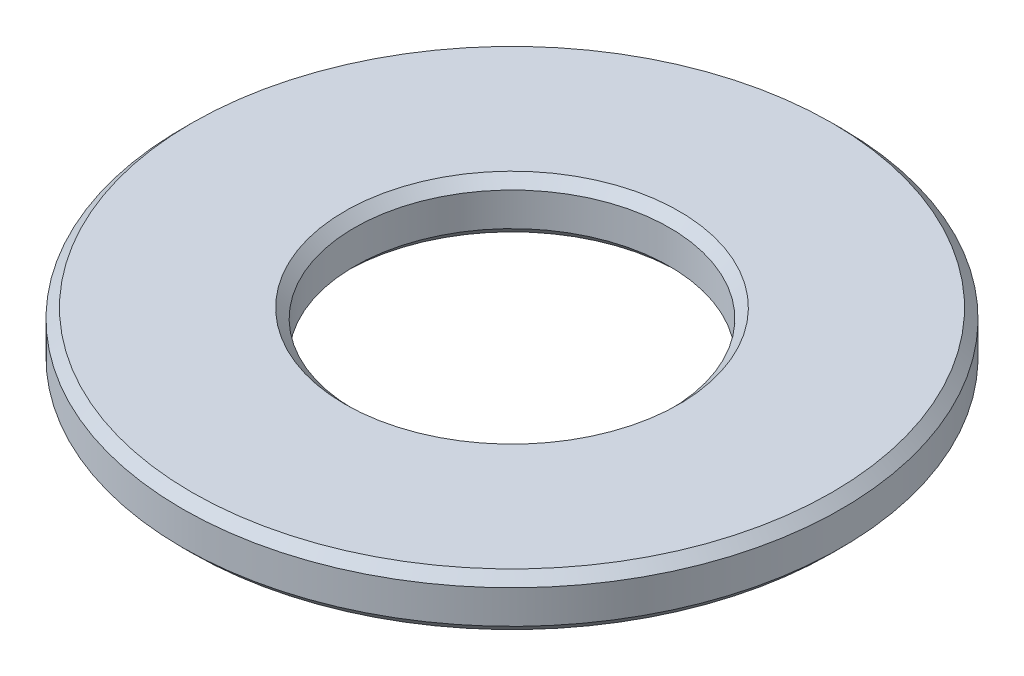
ISO-10303-21;
HEADER;
FILE_DESCRIPTION(('STEP AP214'),'2;1');
FILE_NAME('part.step','',(''),(''),'','','');
FILE_SCHEMA(('AUTOMOTIVE_DESIGN { 1 0 10303 214 1 1 1 1 }'));
ENDSEC;
DATA;
#1=APPLICATION_CONTEXT('core data for automotive mechanical design processes');
#2=APPLICATION_PROTOCOL_DEFINITION('international standard','automotive_design',2000,#1);
#3=PRODUCT_CONTEXT('',#1,'mechanical');
#4=PRODUCT('Part','Part','',(#3));
#5=PRODUCT_RELATED_PRODUCT_CATEGORY('part','',(#4));
#6=PRODUCT_DEFINITION_FORMATION('','',#4);
#7=PRODUCT_DEFINITION_CONTEXT('part definition',#1,'design');
#8=PRODUCT_DEFINITION('design','',#6,#7);
#9=PRODUCT_DEFINITION_SHAPE('','',#8);
#10=(LENGTH_UNIT() NAMED_UNIT(*) SI_UNIT(.MILLI.,.METRE.));
#11=(NAMED_UNIT(*) PLANE_ANGLE_UNIT() SI_UNIT($,.RADIAN.));
#12=(NAMED_UNIT(*) SI_UNIT($,.STERADIAN.) SOLID_ANGLE_UNIT());
#13=UNCERTAINTY_MEASURE_WITH_UNIT(LENGTH_MEASURE(1.E-05),#10,'distance_accuracy_value','');
#14=(GEOMETRIC_REPRESENTATION_CONTEXT(3) GLOBAL_UNCERTAINTY_ASSIGNED_CONTEXT((#13)) GLOBAL_UNIT_ASSIGNED_CONTEXT((#10,
#11,#12)) REPRESENTATION_CONTEXT('',''));
#15=CARTESIAN_POINT('',(0.,0.,0.));
#16=DIRECTION('',(0.,0.,1.));
#17=DIRECTION('',(1.,0.,0.));
#18=AXIS2_PLACEMENT_3D('',#15,#16,#17);
#19=CARTESIAN_POINT('',(0.,0.55,0.));
#20=DIRECTION('',(0.,1.,0.));
#21=DIRECTION('',(0.,0.,1.));
#22=AXIS2_PLACEMENT_3D('',#19,#20,#21);
#23=PLANE('',#22);
#24=CARTESIAN_POINT('',(0.,0.55,0.));
#25=DIRECTION('',(0.,1.,0.));
#26=DIRECTION('',(0.,0.,1.));
#27=AXIS2_PLACEMENT_3D('',#24,#25,#26);
#28=CIRCLE('',#27,3.35);
#29=CARTESIAN_POINT('',(0.,0.55,3.35));
#30=VERTEX_POINT('',#29);
#31=EDGE_CURVE('E61',#30,#30,#28,.T.);
#32=ORIENTED_EDGE('',*,*,#31,.T.);
#33=EDGE_LOOP('',(#32));
#34=FACE_BOUND('',#33,.T.);
#35=CARTESIAN_POINT('',(0.,0.55,0.));
#36=DIRECTION('',(0.,1.,0.));
#37=DIRECTION('',(0.,0.,1.));
#38=AXIS2_PLACEMENT_3D('',#35,#36,#37);
#39=CIRCLE('',#38,1.75);
#40=CARTESIAN_POINT('',(0.,0.55,1.75));
#41=VERTEX_POINT('',#40);
#42=EDGE_CURVE('E64',#41,#41,#39,.F.);
#43=ORIENTED_EDGE('',*,*,#42,.T.);
#44=EDGE_LOOP('',(#43));
#45=FACE_BOUND('',#44,.T.);
#46=ADVANCED_FACE('F35',(#34,#45),#23,.T.);
#47=CARTESIAN_POINT('',(0.,0.,0.));
#48=DIRECTION('',(0.,1.,0.));
#49=DIRECTION('',(0.,0.,1.));
#50=AXIS2_PLACEMENT_3D('',#47,#48,#49);
#51=PLANE('',#50);
#52=CARTESIAN_POINT('',(0.,0.,0.));
#53=DIRECTION('',(0.,1.,0.));
#54=DIRECTION('',(0.,0.,1.));
#55=AXIS2_PLACEMENT_3D('',#52,#53,#54);
#56=CIRCLE('',#55,3.35);
#57=CARTESIAN_POINT('',(0.,0.,3.35));
#58=VERTEX_POINT('',#57);
#59=EDGE_CURVE('E46',#58,#58,#56,.F.);
#60=ORIENTED_EDGE('',*,*,#59,.T.);
#61=EDGE_LOOP('',(#60));
#62=FACE_BOUND('',#61,.T.);
#63=CARTESIAN_POINT('',(0.,0.,0.));
#64=DIRECTION('',(0.,1.,0.));
#65=DIRECTION('',(0.,0.,1.));
#66=AXIS2_PLACEMENT_3D('',#63,#64,#65);
#67=CIRCLE('',#66,1.75);
#68=CARTESIAN_POINT('',(0.,0.,1.75));
#69=VERTEX_POINT('',#68);
#70=EDGE_CURVE('E50',#69,#69,#67,.T.);
#71=ORIENTED_EDGE('',*,*,#70,.T.);
#72=EDGE_LOOP('',(#71));
#73=FACE_BOUND('',#72,.T.);
#74=ADVANCED_FACE('F82',(#62,#73),#51,.F.);
#75=CARTESIAN_POINT('',(0.,0.55,0.));
#76=DIRECTION('',(0.,-1.,0.));
#77=DIRECTION('',(0.,0.,-1.));
#78=AXIS2_PLACEMENT_3D('',#75,#76,#77);
#79=CYLINDRICAL_SURFACE('',#78,3.45);
#80=CARTESIAN_POINT('',(0.,0.45,0.));
#81=DIRECTION('',(0.,1.,0.));
#82=DIRECTION('',(0.,0.,1.));
#83=AXIS2_PLACEMENT_3D('',#80,#81,#82);
#84=CIRCLE('',#83,3.45);
#85=CARTESIAN_POINT('',(0.,0.45,3.45));
#86=VERTEX_POINT('',#85);
#87=EDGE_CURVE('E55',#86,#86,#84,.F.);
#88=ORIENTED_EDGE('',*,*,#87,.T.);
#89=EDGE_LOOP('',(#88));
#90=FACE_BOUND('',#89,.T.);
#91=CARTESIAN_POINT('',(0.,0.0999999999999985,0.));
#92=DIRECTION('',(0.,1.,0.));
#93=DIRECTION('',(0.,0.,1.));
#94=AXIS2_PLACEMENT_3D('',#91,#92,#93);
#95=CIRCLE('',#94,3.45);
#96=CARTESIAN_POINT('',(0.,0.0999999999999985,3.45));
#97=VERTEX_POINT('',#96);
#98=EDGE_CURVE('E58',#97,#97,#95,.T.);
#99=ORIENTED_EDGE('',*,*,#98,.T.);
#100=EDGE_LOOP('',(#99));
#101=FACE_BOUND('',#100,.T.);
#102=ADVANCED_FACE('F88',(#90,#101),#79,.T.);
#103=CARTESIAN_POINT('',(0.,0.55,0.));
#104=DIRECTION('',(0.,-1.,0.));
#105=DIRECTION('',(0.,0.,-1.));
#106=AXIS2_PLACEMENT_3D('',#103,#104,#105);
#107=CYLINDRICAL_SURFACE('',#106,1.65);
#108=CARTESIAN_POINT('',(0.,0.45,0.));
#109=DIRECTION('',(0.,1.,0.));
#110=DIRECTION('',(0.,0.,1.));
#111=AXIS2_PLACEMENT_3D('',#108,#109,#110);
#112=CIRCLE('',#111,1.65);
#113=CARTESIAN_POINT('',(0.,0.45,1.65));
#114=VERTEX_POINT('',#113);
#115=EDGE_CURVE('E10',#114,#114,#112,.T.);
#116=ORIENTED_EDGE('',*,*,#115,.T.);
#117=EDGE_LOOP('',(#116));
#118=FACE_BOUND('',#117,.T.);
#119=CARTESIAN_POINT('',(0.,0.1,0.));
#120=DIRECTION('',(0.,1.,0.));
#121=DIRECTION('',(0.,0.,1.));
#122=AXIS2_PLACEMENT_3D('',#119,#120,#121);
#123=CIRCLE('',#122,1.65);
#124=CARTESIAN_POINT('',(0.,0.1,1.65));
#125=VERTEX_POINT('',#124);
#126=EDGE_CURVE('E42',#125,#125,#123,.F.);
#127=ORIENTED_EDGE('',*,*,#126,.T.);
#128=EDGE_LOOP('',(#127));
#129=FACE_BOUND('',#128,.T.);
#130=ADVANCED_FACE('F92',(#118,#129),#107,.F.);
#131=CARTESIAN_POINT('',(0.,0.55,0.));
#132=DIRECTION('',(0.,-1.,0.));
#133=DIRECTION('',(0.,0.,-1.));
#134=AXIS2_PLACEMENT_3D('',#131,#132,#133);
#135=CONICAL_SURFACE('',#134,3.35,0.785398163397435);
#136=ORIENTED_EDGE('',*,*,#87,.F.);
#137=EDGE_LOOP('',(#136));
#138=FACE_BOUND('',#137,.T.);
#139=ORIENTED_EDGE('',*,*,#31,.F.);
#140=EDGE_LOOP('',(#139));
#141=FACE_BOUND('',#140,.T.);
#142=ADVANCED_FACE('F78',(#138,#141),#135,.T.);
#143=CARTESIAN_POINT('',(0.,0.0999999999999985,0.));
#144=DIRECTION('',(0.,1.,0.));
#145=DIRECTION('',(0.,0.,1.));
#146=AXIS2_PLACEMENT_3D('',#143,#144,#145);
#147=CONICAL_SURFACE('',#146,3.45,0.78539816339745);
#148=ORIENTED_EDGE('',*,*,#59,.F.);
#149=EDGE_LOOP('',(#148));
#150=FACE_BOUND('',#149,.T.);
#151=ORIENTED_EDGE('',*,*,#98,.F.);
#152=EDGE_LOOP('',(#151));
#153=FACE_BOUND('',#152,.T.);
#154=ADVANCED_FACE('F72',(#150,#153),#147,.T.);
#155=CARTESIAN_POINT('',(0.,0.45,0.));
#156=DIRECTION('',(0.,1.,0.));
#157=DIRECTION('',(0.,0.,1.));
#158=AXIS2_PLACEMENT_3D('',#155,#156,#157);
#159=CONICAL_SURFACE('',#158,1.65,0.785398163397453);
#160=ORIENTED_EDGE('',*,*,#42,.F.);
#161=EDGE_LOOP('',(#160));
#162=FACE_BOUND('',#161,.T.);
#163=ORIENTED_EDGE('',*,*,#115,.F.);
#164=EDGE_LOOP('',(#163));
#165=FACE_BOUND('',#164,.T.);
#166=ADVANCED_FACE('F69',(#162,#165),#159,.F.);
#167=CARTESIAN_POINT('',(0.,0.,0.));
#168=DIRECTION('',(0.,-1.,0.));
#169=DIRECTION('',(0.,0.,-1.));
#170=AXIS2_PLACEMENT_3D('',#167,#168,#169);
#171=CONICAL_SURFACE('',#170,1.75,0.78539816339744);
#172=ORIENTED_EDGE('',*,*,#126,.F.);
#173=EDGE_LOOP('',(#172));
#174=FACE_BOUND('',#173,.T.);
#175=ORIENTED_EDGE('',*,*,#70,.F.);
#176=EDGE_LOOP('',(#175));
#177=FACE_BOUND('',#176,.T.);
#178=ADVANCED_FACE('F37',(#174,#177),#171,.F.);
#179=CLOSED_SHELL('',(#46,#74,#102,#130,#142,#154,#166,#178));
#180=MANIFOLD_SOLID_BREP('B2',#179);
#181=ADVANCED_BREP_SHAPE_REPRESENTATION('',(#18,#180),#14);
#182=SHAPE_DEFINITION_REPRESENTATION(#9,#181);
ENDSEC;
END-ISO-10303-21;
